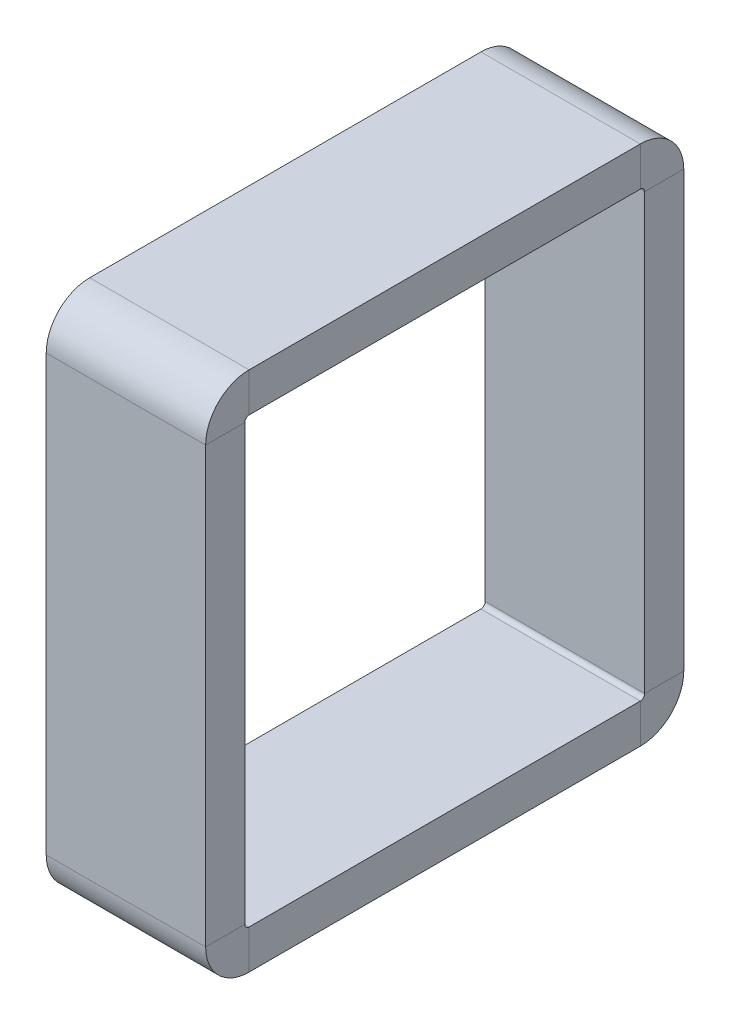
ISO-10303-21;
HEADER;
FILE_DESCRIPTION(('STEP AP214'),'2;1');
FILE_NAME('part.step','',(''),(''),'','','');
FILE_SCHEMA(('AUTOMOTIVE_DESIGN { 1 0 10303 214 1 1 1 1 }'));
ENDSEC;
DATA;
#1=APPLICATION_CONTEXT('core data for automotive mechanical design processes');
#2=APPLICATION_PROTOCOL_DEFINITION('international standard','automotive_design',2000,#1);
#3=PRODUCT_CONTEXT('',#1,'mechanical');
#4=PRODUCT('Part','Part','',(#3));
#5=PRODUCT_RELATED_PRODUCT_CATEGORY('part','',(#4));
#6=PRODUCT_DEFINITION_FORMATION('','',#4);
#7=PRODUCT_DEFINITION_CONTEXT('part definition',#1,'design');
#8=PRODUCT_DEFINITION('design','',#6,#7);
#9=PRODUCT_DEFINITION_SHAPE('','',#8);
#10=(LENGTH_UNIT() NAMED_UNIT(*) SI_UNIT(.MILLI.,.METRE.));
#11=(NAMED_UNIT(*) PLANE_ANGLE_UNIT() SI_UNIT($,.RADIAN.));
#12=(NAMED_UNIT(*) SI_UNIT($,.STERADIAN.) SOLID_ANGLE_UNIT());
#13=UNCERTAINTY_MEASURE_WITH_UNIT(LENGTH_MEASURE(1.E-05),#10,'distance_accuracy_value','');
#14=(GEOMETRIC_REPRESENTATION_CONTEXT(3) GLOBAL_UNCERTAINTY_ASSIGNED_CONTEXT((#13)) GLOBAL_UNIT_ASSIGNED_CONTEXT((#10,
#11,#12)) REPRESENTATION_CONTEXT('',''));
#15=CARTESIAN_POINT('',(0.,0.,0.));
#16=DIRECTION('',(0.,0.,1.));
#17=DIRECTION('',(1.,0.,0.));
#18=AXIS2_PLACEMENT_3D('',#15,#16,#17);
#19=CARTESIAN_POINT('',(-3.71677795736343,-0.754999569129981,-3.24612158699929));
#20=DIRECTION('',(1.,-1.74845553146952E-07,0.));
#21=DIRECTION('',(0.,8.74227765734758E-08,-1.));
#22=AXIS2_PLACEMENT_3D('',#19,#20,#21);
#23=PLANE('',#22);
#24=CARTESIAN_POINT('',(-3.7167779564892,-0.749999568692863,-3.25112158656218));
#25=DIRECTION('',(-0.999999999999985,1.74845553146949E-07,0.));
#26=DIRECTION('',(1.74845553146948E-07,0.999999999999981,8.74190497768619E-08));
#27=AXIS2_PLACEMENT_3D('',#24,#25,#26);
#28=CIRCLE('',#27,0.00999999999999571);
#29=CARTESIAN_POINT('',(-3.71677795474075,-0.739999568692867,-3.25112158568795));
#30=VERTEX_POINT('',#29);
#31=CARTESIAN_POINT('',(-3.7167779564892,-0.749999567819639,-3.26112158656218));
#32=VERTEX_POINT('',#31);
#33=EDGE_CURVE('E11',#30,#32,#28,.T.);
#34=ORIENTED_EDGE('',*,*,#33,.F.);
#35=DIRECTION('',(-1.74845555319994E-07,-0.999999999999981,-8.74227801271592E-08));
#36=VECTOR('',#35,1.);
#37=CARTESIAN_POINT('',(-3.71677793900465,-0.649999568693867,-3.2511215778209));
#38=LINE('',#37,#36);
#39=CARTESIAN_POINT('',(-3.71677793900465,-0.649999568693867,-3.2511215778199));
#40=VERTEX_POINT('',#39);
#41=EDGE_CURVE('E295',#40,#30,#38,.T.);
#42=ORIENTED_EDGE('',*,*,#41,.F.);
#43=CARTESIAN_POINT('',(-3.7167779564892,-0.749999568693535,-3.25112158656251));
#44=DIRECTION('',(0.999999999999985,-1.74845553146949E-07,0.));
#45=DIRECTION('',(0.,8.74290018163111E-08,-0.999999999999996));
#46=AXIS2_PLACEMENT_3D('',#43,#44,#45);
#47=CIRCLE('',#46,0.0999999999996649);
#48=CARTESIAN_POINT('',(-3.7167779564892,-0.749999559951589,-3.35112158656218));
#49=VERTEX_POINT('',#48);
#50=EDGE_CURVE('E292',#49,#40,#47,.T.);
#51=ORIENTED_EDGE('',*,*,#50,.F.);
#52=DIRECTION('',(0.,8.74227825933516E-08,-0.999999999999996));
#53=VECTOR('',#52,1.);
#54=CARTESIAN_POINT('',(-3.7167779564892,-0.749999567818639,-3.26112158656218));
#55=LINE('',#54,#53);
#56=EDGE_CURVE('E281',#32,#49,#55,.T.);
#57=ORIENTED_EDGE('',*,*,#56,.F.);
#58=EDGE_LOOP('',(#34,#42,#51,#57));
#59=FACE_BOUND('',#58,.T.);
#60=ADVANCED_FACE('F17',(#59),#23,.F.);
#61=CARTESIAN_POINT('',(-3.35000013200843,-0.754999633259452,-3.24612158699929));
#62=DIRECTION('',(1.,-1.74845553146952E-07,0.));
#63=DIRECTION('',(0.,8.74227765734758E-08,-1.));
#64=AXIS2_PLACEMENT_3D('',#61,#62,#63);
#65=PLANE('',#64);
#66=DIRECTION('',(0.,8.74227764254459E-08,-0.999999999999996));
#67=VECTOR('',#66,1.);
#68=CARTESIAN_POINT('',(-3.3500001311342,-0.749999631948111,-3.26112158656218));
#69=LINE('',#68,#67);
#70=CARTESIAN_POINT('',(-3.3500001311342,-0.749999631949111,-3.26112158656218));
#71=VERTEX_POINT('',#70);
#72=CARTESIAN_POINT('',(-3.3500001311342,-0.749999624081061,-3.35112158656218));
#73=VERTEX_POINT('',#72);
#74=EDGE_CURVE('E24',#71,#73,#69,.T.);
#75=ORIENTED_EDGE('',*,*,#74,.T.);
#76=CARTESIAN_POINT('',(-3.3500001311342,-0.749999632823002,-3.25112158656251));
#77=DIRECTION('',(0.999999999999985,-1.74845553146949E-07,0.));
#78=DIRECTION('',(0.,8.74294103783842E-08,-0.999999999999996));
#79=AXIS2_PLACEMENT_3D('',#76,#77,#78);
#80=CIRCLE('',#79,0.0999999999996649);
#81=CARTESIAN_POINT('',(-3.35000011364965,-0.649999632822338,-3.2511215778199));
#82=VERTEX_POINT('',#81);
#83=EDGE_CURVE('E290',#73,#82,#80,.T.);
#84=ORIENTED_EDGE('',*,*,#83,.T.);
#85=DIRECTION('',(1.74845555319994E-07,0.999999999999981,8.74227801271592E-08));
#86=VECTOR('',#85,1.);
#87=CARTESIAN_POINT('',(-3.35000012938575,-0.739999632822338,-3.25112158568895));
#88=LINE('',#87,#86);
#89=CARTESIAN_POINT('',(-3.35000012938575,-0.739999632822338,-3.25112158568795));
#90=VERTEX_POINT('',#89);
#91=EDGE_CURVE('E284',#90,#82,#88,.T.);
#92=ORIENTED_EDGE('',*,*,#91,.F.);
#93=CARTESIAN_POINT('',(-3.3500001311342,-0.749999632822289,-3.25112158656223));
#94=DIRECTION('',(-0.999999999999985,1.74845553146949E-07,0.));
#95=DIRECTION('',(1.74845553146948E-07,0.999999999999981,8.7427665107533E-08));
#96=AXIS2_PLACEMENT_3D('',#93,#94,#95);
#97=CIRCLE('',#96,0.00999999999999571);
#98=EDGE_CURVE('E274',#90,#71,#97,.T.);
#99=ORIENTED_EDGE('',*,*,#98,.T.);
#100=EDGE_LOOP('',(#75,#84,#92,#99));
#101=FACE_BOUND('',#100,.T.);
#102=ADVANCED_FACE('F409',(#101),#65,.T.);
#103=CARTESIAN_POINT('',(-3.7167779564892,-0.749999568693535,-3.25112158656251));
#104=DIRECTION('',(1.,-1.74845540855596E-07,0.));
#105=DIRECTION('',(-1.74845540855597E-07,-1.,-8.74227765734759E-08));
#106=AXIS2_PLACEMENT_3D('',#103,#104,#105);
#107=CYLINDRICAL_SURFACE('',#106,0.0999999999996679);
#108=ORIENTED_EDGE('',*,*,#50,.T.);
#109=DIRECTION('',(-0.999999999999985,1.74845553083486E-07,0.));
#110=VECTOR('',#109,1.);
#111=CARTESIAN_POINT('',(-3.35000011364965,-0.649999632823338,-3.2511215778209));
#112=LINE('',#111,#110);
#113=EDGE_CURVE('E287',#82,#40,#112,.T.);
#114=ORIENTED_EDGE('',*,*,#113,.F.);
#115=ORIENTED_EDGE('',*,*,#83,.F.);
#116=DIRECTION('',(0.999999999999985,-1.74845553083486E-07,0.));
#117=VECTOR('',#116,1.);
#118=CARTESIAN_POINT('',(-3.7167779564892,-0.749999559950589,-3.35112158656218));
#119=LINE('',#118,#117);
#120=EDGE_CURVE('E268',#49,#73,#119,.T.);
#121=ORIENTED_EDGE('',*,*,#120,.F.);
#122=EDGE_LOOP('',(#108,#114,#115,#121));
#123=FACE_BOUND('',#122,.T.);
#124=ADVANCED_FACE('F345',(#123),#107,.T.);
#125=CARTESIAN_POINT('',(-3.7167779564892,-0.749999568692863,-3.25112158656218));
#126=DIRECTION('',(-1.,1.74845430233397E-07,1.22913533173692E-13));
#127=DIRECTION('',(-1.74845430233408E-07,-1.,-8.74227765734759E-08));
#128=AXIS2_PLACEMENT_3D('',#125,#126,#127);
#129=CYLINDRICAL_SURFACE('',#128,0.00999999999999601);
#130=ORIENTED_EDGE('',*,*,#33,.T.);
#131=DIRECTION('',(0.999999999999985,-1.74844189739207E-07,0.));
#132=VECTOR('',#131,1.);
#133=CARTESIAN_POINT('',(-3.7167779564892,-0.749999567818889,-3.26112158656218));
#134=LINE('',#133,#132);
#135=EDGE_CURVE('E276',#32,#71,#134,.T.);
#136=ORIENTED_EDGE('',*,*,#135,.T.);
#137=ORIENTED_EDGE('',*,*,#98,.F.);
#138=DIRECTION('',(0.999999999999985,-1.74845553083486E-07,0.));
#139=VECTOR('',#138,1.);
#140=CARTESIAN_POINT('',(-3.71677795474075,-0.739999568692867,-3.25112158568895));
#141=LINE('',#140,#139);
#142=EDGE_CURVE('E262',#30,#90,#141,.T.);
#143=ORIENTED_EDGE('',*,*,#142,.F.);
#144=EDGE_LOOP('',(#130,#136,#137,#143));
#145=FACE_BOUND('',#144,.T.);
#146=ADVANCED_FACE('F304',(#145),#129,.F.);
#147=CARTESIAN_POINT('',(-3.71677793900466,-0.649999647374366,-2.3511215778209));
#148=DIRECTION('',(1.,-1.74845553146952E-07,0.));
#149=DIRECTION('',(-1.74845553146952E-07,-1.,-8.74227765734759E-08));
#150=AXIS2_PLACEMENT_3D('',#147,#148,#149);
#151=PLANE('',#150);
#152=DIRECTION('',(0.,8.7422776548804E-08,-0.999999999999996));
#153=VECTOR('',#152,1.);
#154=CARTESIAN_POINT('',(-3.71677793900466,-0.649999647374366,-2.3511215778209));
#155=LINE('',#154,#153);
#156=CARTESIAN_POINT('',(-3.71677793900366,-0.649999647377366,-2.3511215778179));
#157=VERTEX_POINT('',#156);
#158=EDGE_CURVE('E278',#157,#40,#155,.T.);
#159=ORIENTED_EDGE('',*,*,#158,.T.);
#160=ORIENTED_EDGE('',*,*,#41,.T.);
#161=DIRECTION('',(0.,8.74227765488039E-08,-0.999999999999996));
#162=VECTOR('',#161,1.);
#163=CARTESIAN_POINT('',(-3.71677795474076,-0.739999647373366,-2.35112158568895));
#164=LINE('',#163,#162);
#165=CARTESIAN_POINT('',(-3.71677795473976,-0.739999647376365,-2.35112158568595));
#166=VERTEX_POINT('',#165);
#167=EDGE_CURVE('E265',#166,#30,#164,.T.);
#168=ORIENTED_EDGE('',*,*,#167,.F.);
#169=DIRECTION('',(-1.74845550387524E-07,-0.999999999999981,-8.74121663959712E-08));
#170=VECTOR('',#169,1.);
#171=CARTESIAN_POINT('',(-3.71677793900366,-0.649999647375321,-2.35112157782185));
#172=LINE('',#171,#170);
#173=EDGE_CURVE('E147',#157,#166,#172,.T.);
#174=ORIENTED_EDGE('',*,*,#173,.F.);
#175=EDGE_LOOP('',(#159,#160,#168,#174));
#176=FACE_BOUND('',#175,.T.);
#177=ADVANCED_FACE('F297',(#176),#151,.F.);
#178=CARTESIAN_POINT('',(-3.35000011364966,-0.649999711503837,-2.3511215778209));
#179=DIRECTION('',(-1.74845553146952E-07,-1.,-8.74227765734759E-08));
#180=DIRECTION('',(-1.,1.74845553146952E-07,0.));
#181=AXIS2_PLACEMENT_3D('',#178,#179,#180);
#182=PLANE('',#181);
#183=DIRECTION('',(0.,8.7422776548804E-08,-0.999999999999996));
#184=VECTOR('',#183,1.);
#185=CARTESIAN_POINT('',(-3.35000011364966,-0.649999711503837,-2.3511215778209));
#186=LINE('',#185,#184);
#187=CARTESIAN_POINT('',(-3.35000011365066,-0.649999711506837,-2.3511215778179));
#188=VERTEX_POINT('',#187);
#189=EDGE_CURVE('E271',#188,#82,#186,.T.);
#190=ORIENTED_EDGE('',*,*,#189,.T.);
#191=ORIENTED_EDGE('',*,*,#113,.T.);
#192=ORIENTED_EDGE('',*,*,#158,.F.);
#193=DIRECTION('',(-0.999999999999985,1.74845553083486E-07,0.));
#194=VECTOR('',#193,1.);
#195=CARTESIAN_POINT('',(-3.35000011364966,-0.649999711503837,-2.3511215778209));
#196=LINE('',#195,#194);
#197=EDGE_CURVE('E255',#188,#157,#196,.T.);
#198=ORIENTED_EDGE('',*,*,#197,.F.);
#199=EDGE_LOOP('',(#190,#191,#192,#198));
#200=FACE_BOUND('',#199,.T.);
#201=ADVANCED_FACE('F342',(#200),#182,.F.);
#202=CARTESIAN_POINT('',(-3.71677795474076,-0.739999647373366,-2.35112158568895));
#203=DIRECTION('',(1.74845553146952E-07,1.,8.74227765734759E-08));
#204=DIRECTION('',(1.,-1.74845553146952E-07,0.));
#205=AXIS2_PLACEMENT_3D('',#202,#203,#204);
#206=PLANE('',#205);
#207=ORIENTED_EDGE('',*,*,#167,.T.);
#208=ORIENTED_EDGE('',*,*,#142,.T.);
#209=DIRECTION('',(0.,8.74227765488039E-08,-0.999999999999996));
#210=VECTOR('',#209,1.);
#211=CARTESIAN_POINT('',(-3.35000012938576,-0.739999711502837,-2.35112158568895));
#212=LINE('',#211,#210);
#213=CARTESIAN_POINT('',(-3.35000012938676,-0.739999711505837,-2.35112158568595));
#214=VERTEX_POINT('',#213);
#215=EDGE_CURVE('E259',#214,#90,#212,.T.);
#216=ORIENTED_EDGE('',*,*,#215,.F.);
#217=DIRECTION('',(0.999999999999985,-1.74845553083486E-07,0.));
#218=VECTOR('',#217,1.);
#219=CARTESIAN_POINT('',(-3.71677795474076,-0.739999647373366,-2.35112158568895));
#220=LINE('',#219,#218);
#221=EDGE_CURVE('E251',#166,#214,#220,.T.);
#222=ORIENTED_EDGE('',*,*,#221,.F.);
#223=EDGE_LOOP('',(#207,#208,#216,#222));
#224=FACE_BOUND('',#223,.T.);
#225=ADVANCED_FACE('F301',(#224),#206,.F.);
#226=CARTESIAN_POINT('',(-3.35000012938576,-0.739999711502837,-2.35112158568895));
#227=DIRECTION('',(-1.,1.74845553146952E-07,0.));
#228=DIRECTION('',(1.74845553146952E-07,1.,8.74227765734759E-08));
#229=AXIS2_PLACEMENT_3D('',#226,#227,#228);
#230=PLANE('',#229);
#231=ORIENTED_EDGE('',*,*,#215,.T.);
#232=ORIENTED_EDGE('',*,*,#91,.T.);
#233=ORIENTED_EDGE('',*,*,#189,.F.);
#234=DIRECTION('',(1.7484555038515E-07,0.999999999999981,8.74231995444866E-08));
#235=VECTOR('',#234,1.);
#236=CARTESIAN_POINT('',(-3.35000012938676,-0.739999711503105,-2.35112158568899));
#237=LINE('',#236,#235);
#238=EDGE_CURVE('E242',#214,#188,#237,.T.);
#239=ORIENTED_EDGE('',*,*,#238,.F.);
#240=EDGE_LOOP('',(#231,#232,#233,#239));
#241=FACE_BOUND('',#240,.T.);
#242=ADVANCED_FACE('F308',(#241),#230,.F.);
#243=CARTESIAN_POINT('',(-3.71677814007703,-1.79999955557945,-3.40112167835709));
#244=DIRECTION('',(-1.,1.74845553146952E-07,0.));
#245=DIRECTION('',(0.,-8.74227765734759E-08,1.));
#246=AXIS2_PLACEMENT_3D('',#243,#244,#245);
#247=PLANE('',#246);
#248=ORIENTED_EDGE('',*,*,#56,.T.);
#249=DIRECTION('',(-1.74845553146948E-07,-0.999999999999981,-8.74247767512754E-08));
#250=VECTOR('',#249,1.);
#251=CARTESIAN_POINT('',(-3.7167779564892,-0.749999559950589,-3.35112158656218));
#252=LINE('',#251,#250);
#253=CARTESIAN_POINT('',(-3.71677813133475,-1.74999955994959,-3.35112167398595));
#254=VERTEX_POINT('',#253);
#255=EDGE_CURVE('E253',#49,#254,#252,.T.);
#256=ORIENTED_EDGE('',*,*,#255,.T.);
#257=DIRECTION('',(0.,-8.74338872897881E-08,0.999999999999996));
#258=VECTOR('',#257,1.);
#259=CARTESIAN_POINT('',(-3.71677813133475,-1.74999955995059,-3.35112167398695));
#260=LINE('',#259,#258);
#261=CARTESIAN_POINT('',(-3.71677813133376,-1.74999956781864,-3.26112167398595));
#262=VERTEX_POINT('',#261);
#263=EDGE_CURVE('E245',#254,#262,#260,.T.);
#264=ORIENTED_EDGE('',*,*,#263,.T.);
#265=DIRECTION('',(1.74845553146774E-07,0.999999999999981,8.74237762181981E-08));
#266=VECTOR('',#265,1.);
#267=CARTESIAN_POINT('',(-3.71677813133476,-1.74999956781964,-3.26112167398595));
#268=LINE('',#267,#266);
#269=EDGE_CURVE('E233',#262,#32,#268,.T.);
#270=ORIENTED_EDGE('',*,*,#269,.T.);
#271=EDGE_LOOP('',(#248,#256,#264,#270));
#272=FACE_BOUND('',#271,.T.);
#273=ADVANCED_FACE('F350',(#272),#247,.T.);
#274=CARTESIAN_POINT('',(-3.7167779564892,-0.749999559950589,-3.35112158656218));
#275=DIRECTION('',(0.,-8.7424776751277E-08,1.));
#276=DIRECTION('',(-1.74845553146952E-07,-1.,-8.7424776751277E-08));
#277=AXIS2_PLACEMENT_3D('',#274,#275,#276);
#278=PLANE('',#277);
#279=ORIENTED_EDGE('',*,*,#120,.T.);
#280=DIRECTION('',(-1.74845553146948E-07,-0.999999999999981,-8.74247767512754E-08));
#281=VECTOR('',#280,1.);
#282=CARTESIAN_POINT('',(-3.3500001311342,-0.749999624080061,-3.35112158656218));
#283=LINE('',#282,#281);
#284=CARTESIAN_POINT('',(-3.35000030598076,-1.74999962407906,-3.35112167398595));
#285=VERTEX_POINT('',#284);
#286=EDGE_CURVE('E247',#73,#285,#283,.T.);
#287=ORIENTED_EDGE('',*,*,#286,.T.);
#288=DIRECTION('',(0.999999999999985,-1.74845553083486E-07,0.));
#289=VECTOR('',#288,1.);
#290=CARTESIAN_POINT('',(-3.71677813133476,-1.74999955995059,-3.35112167398695));
#291=LINE('',#290,#289);
#292=EDGE_CURVE('E236',#254,#285,#291,.T.);
#293=ORIENTED_EDGE('',*,*,#292,.F.);
#294=ORIENTED_EDGE('',*,*,#255,.F.);
#295=EDGE_LOOP('',(#279,#287,#293,#294));
#296=FACE_BOUND('',#295,.T.);
#297=ADVANCED_FACE('F364',(#296),#278,.F.);
#298=CARTESIAN_POINT('',(-3.71677813133476,-1.74999956781964,-3.26112167398595));
#299=DIRECTION('',(0.,8.74237762182872E-08,-1.));
#300=DIRECTION('',(1.74845553146952E-07,1.,8.74237762182872E-08));
#301=AXIS2_PLACEMENT_3D('',#298,#299,#300);
#302=PLANE('',#301);
#303=DIRECTION('',(0.999999999999985,-1.74844189739207E-07,0.));
#304=VECTOR('',#303,1.);
#305=CARTESIAN_POINT('',(-3.71677813133476,-1.74999956781939,-3.26112167398595));
#306=LINE('',#305,#304);
#307=CARTESIAN_POINT('',(-3.35000030598076,-1.74999963194711,-3.26112167398595));
#308=VERTEX_POINT('',#307);
#309=EDGE_CURVE('E249',#262,#308,#306,.T.);
#310=ORIENTED_EDGE('',*,*,#309,.T.);
#311=DIRECTION('',(1.74845553146861E-07,0.999999999999981,8.74237762182418E-08));
#312=VECTOR('',#311,1.);
#313=CARTESIAN_POINT('',(-3.35000030597976,-1.74999963194836,-3.26112167398595));
#314=LINE('',#313,#312);
#315=EDGE_CURVE('E239',#308,#71,#314,.T.);
#316=ORIENTED_EDGE('',*,*,#315,.T.);
#317=ORIENTED_EDGE('',*,*,#135,.F.);
#318=ORIENTED_EDGE('',*,*,#269,.F.);
#319=EDGE_LOOP('',(#310,#316,#317,#318));
#320=FACE_BOUND('',#319,.T.);
#321=ADVANCED_FACE('F355',(#320),#302,.F.);
#322=CARTESIAN_POINT('',(-3.35000031472203,-1.79999961970892,-3.40112167835709));
#323=DIRECTION('',(-1.,1.74845553146952E-07,0.));
#324=DIRECTION('',(0.,-8.74227765734759E-08,1.));
#325=AXIS2_PLACEMENT_3D('',#322,#323,#324);
#326=PLANE('',#325);
#327=ORIENTED_EDGE('',*,*,#315,.F.);
#328=DIRECTION('',(0.,-8.74333864567739E-08,0.999999999999996));
#329=VECTOR('',#328,1.);
#330=CARTESIAN_POINT('',(-3.35000030597975,-1.74999962407911,-3.351121673986));
#331=LINE('',#330,#329);
#332=EDGE_CURVE('E228',#285,#308,#331,.T.);
#333=ORIENTED_EDGE('',*,*,#332,.F.);
#334=ORIENTED_EDGE('',*,*,#286,.F.);
#335=ORIENTED_EDGE('',*,*,#74,.F.);
#336=EDGE_LOOP('',(#327,#333,#334,#335));
#337=FACE_BOUND('',#336,.T.);
#338=ADVANCED_FACE('F361',(#337),#326,.F.);
#339=CARTESIAN_POINT('',(-3.71677814969354,-1.85499956912898,-3.24612168316634));
#340=DIRECTION('',(1.,-1.74845553146952E-07,0.));
#341=DIRECTION('',(0.,8.74227765734759E-08,-1.));
#342=AXIS2_PLACEMENT_3D('',#339,#340,#341);
#343=PLANE('',#342);
#344=CARTESIAN_POINT('',(-3.71677813133476,-1.74999956869287,-3.25112167398596));
#345=DIRECTION('',(-0.999999999999985,1.74845553146949E-07,0.));
#346=DIRECTION('',(0.,8.74249561633322E-08,-0.999999999999996));
#347=AXIS2_PLACEMENT_3D('',#344,#345,#346);
#348=CIRCLE('',#347,0.0099999999999977);
#349=CARTESIAN_POINT('',(-3.71677813308221,-1.75999956869287,-3.25112167486018));
#350=VERTEX_POINT('',#349);
#351=EDGE_CURVE('E231',#262,#350,#348,.T.);
#352=ORIENTED_EDGE('',*,*,#351,.F.);
#353=ORIENTED_EDGE('',*,*,#263,.F.);
#354=CARTESIAN_POINT('',(-3.71677813133476,-1.74999956869307,-3.25112167398716));
#355=DIRECTION('',(0.999999999999985,-1.74845553146949E-07,0.));
#356=DIRECTION('',(-1.74845553146948E-07,-0.999999999999981,-8.74205197131637E-08));
#357=AXIS2_PLACEMENT_3D('',#354,#355,#356);
#358=CIRCLE('',#357,0.099999999998794);
#359=CARTESIAN_POINT('',(-3.71677814881831,-1.84999956869187,-3.25112168272823));
#360=VERTEX_POINT('',#359);
#361=EDGE_CURVE('E225',#360,#254,#358,.T.);
#362=ORIENTED_EDGE('',*,*,#361,.F.);
#363=DIRECTION('',(-1.74845555319994E-07,-0.999999999999981,-8.74338823574056E-08));
#364=VECTOR('',#363,1.);
#365=CARTESIAN_POINT('',(-3.71677813308321,-1.75999956869287,-3.25112167486018));
#366=LINE('',#365,#364);
#367=EDGE_CURVE('E215',#350,#360,#366,.T.);
#368=ORIENTED_EDGE('',*,*,#367,.F.);
#369=EDGE_LOOP('',(#352,#353,#362,#368));
#370=FACE_BOUND('',#369,.T.);
#371=ADVANCED_FACE('F372',(#370),#343,.F.);
#372=CARTESIAN_POINT('',(-3.71677813133475,-1.74999956869307,-3.25112167398716));
#373=DIRECTION('',(1.,-1.74845565438305E-07,0.));
#374=DIRECTION('',(-1.74845565438306E-07,-1.,-8.74227765734759E-08));
#375=AXIS2_PLACEMENT_3D('',#372,#373,#374);
#376=CYLINDRICAL_SURFACE('',#375,0.0999999999987971);
#377=ORIENTED_EDGE('',*,*,#361,.T.);
#378=ORIENTED_EDGE('',*,*,#292,.T.);
#379=CARTESIAN_POINT('',(-3.35000030597976,-1.74999963282255,-3.25112167398716));
#380=DIRECTION('',(0.999999999999985,-1.74845553146949E-07,0.));
#381=DIRECTION('',(-1.74845553146948E-07,-0.999999999999981,-8.74204753042427E-08));
#382=AXIS2_PLACEMENT_3D('',#379,#380,#381);
#383=CIRCLE('',#382,0.099999999998794);
#384=CARTESIAN_POINT('',(-3.35000032346531,-1.84999963282134,-3.25112168272823));
#385=VERTEX_POINT('',#384);
#386=EDGE_CURVE('E218',#385,#285,#383,.T.);
#387=ORIENTED_EDGE('',*,*,#386,.F.);
#388=DIRECTION('',(0.999999999999985,-1.74845553083487E-07,0.));
#389=VECTOR('',#388,1.);
#390=CARTESIAN_POINT('',(-3.71677814881931,-1.84999956869187,-3.25112168272923));
#391=LINE('',#390,#389);
#392=EDGE_CURVE('E209',#360,#385,#391,.T.);
#393=ORIENTED_EDGE('',*,*,#392,.F.);
#394=EDGE_LOOP('',(#377,#378,#387,#393));
#395=FACE_BOUND('',#394,.T.);
#396=ADVANCED_FACE('F368',(#395),#376,.T.);
#397=CARTESIAN_POINT('',(-3.71677813133475,-1.74999956869287,-3.25112167398596));
#398=DIRECTION('',(-1.,1.74845676060485E-07,1.22913554664589E-13));
#399=DIRECTION('',(-1.74845676060496E-07,-1.,-8.74227765734759E-08));
#400=AXIS2_PLACEMENT_3D('',#397,#398,#399);
#401=CYLINDRICAL_SURFACE('',#400,0.00999999999999801);
#402=ORIENTED_EDGE('',*,*,#351,.T.);
#403=DIRECTION('',(0.999999999999985,-1.74842826394926E-07,0.));
#404=VECTOR('',#403,1.);
#405=CARTESIAN_POINT('',(-3.71677813308321,-1.75999956869287,-3.25112167486018));
#406=LINE('',#405,#404);
#407=CARTESIAN_POINT('',(-3.35000030772921,-1.75999963282134,-3.25112167486018));
#408=VERTEX_POINT('',#407);
#409=EDGE_CURVE('E221',#350,#408,#406,.T.);
#410=ORIENTED_EDGE('',*,*,#409,.T.);
#411=CARTESIAN_POINT('',(-3.35000030597976,-1.74999963282239,-3.251121673986));
#412=DIRECTION('',(-0.999999999999985,1.74845553146949E-07,0.));
#413=DIRECTION('',(0.,8.75294725588704E-08,-0.999999999999996));
#414=AXIS2_PLACEMENT_3D('',#411,#412,#413);
#415=CIRCLE('',#414,0.0099999999999977);
#416=EDGE_CURVE('E212',#308,#408,#415,.T.);
#417=ORIENTED_EDGE('',*,*,#416,.F.);
#418=ORIENTED_EDGE('',*,*,#309,.F.);
#419=EDGE_LOOP('',(#402,#410,#417,#418));
#420=FACE_BOUND('',#419,.T.);
#421=ADVANCED_FACE('F374',(#420),#401,.F.);
#422=CARTESIAN_POINT('',(-3.35000032433854,-1.85499963325845,-3.24612168316634));
#423=DIRECTION('',(1.,-1.74845553146952E-07,0.));
#424=DIRECTION('',(0.,8.74227765734759E-08,-1.));
#425=AXIS2_PLACEMENT_3D('',#422,#423,#424);
#426=PLANE('',#425);
#427=DIRECTION('',(-1.74845550383717E-07,-0.999999999999981,-8.74348938929626E-08));
#428=VECTOR('',#427,1.);
#429=CARTESIAN_POINT('',(-3.35000030772821,-1.75999963282133,-3.25112167486009));
#430=LINE('',#429,#428);
#431=EDGE_CURVE('E223',#408,#385,#430,.T.);
#432=ORIENTED_EDGE('',*,*,#431,.T.);
#433=ORIENTED_EDGE('',*,*,#386,.T.);
#434=ORIENTED_EDGE('',*,*,#332,.T.);
#435=ORIENTED_EDGE('',*,*,#416,.T.);
#436=EDGE_LOOP('',(#432,#433,#434,#435));
#437=FACE_BOUND('',#436,.T.);
#438=ADVANCED_FACE('F377',(#437),#426,.T.);
#439=CARTESIAN_POINT('',(-3.71677815668736,-1.89499956476084,-3.29612168666326));
#440=DIRECTION('',(-1.,1.74845553146952E-07,0.));
#441=DIRECTION('',(0.,-8.74227765734759E-08,1.));
#442=AXIS2_PLACEMENT_3D('',#439,#440,#441);
#443=PLANE('',#442);
#444=ORIENTED_EDGE('',*,*,#367,.T.);
#445=DIRECTION('',(0.,-8.74261100551144E-08,0.999999999999996));
#446=VECTOR('',#445,1.);
#447=CARTESIAN_POINT('',(-3.71677814881931,-1.84999956869187,-3.25112168272923));
#448=LINE('',#447,#446);
#449=CARTESIAN_POINT('',(-3.71677814881832,-1.84999964737537,-2.35112168273023));
#450=VERTEX_POINT('',#449);
#451=EDGE_CURVE('E207',#360,#450,#448,.T.);
#452=ORIENTED_EDGE('',*,*,#451,.T.);
#453=DIRECTION('',(1.74845555318051E-07,0.999999999999981,8.74227653232141E-08));
#454=VECTOR('',#453,1.);
#455=CARTESIAN_POINT('',(-3.71677814881933,-1.84999964737537,-2.35112168272923));
#456=LINE('',#455,#454);
#457=CARTESIAN_POINT('',(-3.71677813308223,-1.75999964737537,-2.35112167486118));
#458=VERTEX_POINT('',#457);
#459=EDGE_CURVE('E201',#450,#458,#456,.T.);
#460=ORIENTED_EDGE('',*,*,#459,.T.);
#461=DIRECTION('',(0.,8.74249985986058E-08,-0.999999999999996));
#462=VECTOR('',#461,1.);
#463=CARTESIAN_POINT('',(-3.71677813308323,-1.75999964737537,-2.35112167486118));
#464=LINE('',#463,#462);
#465=EDGE_CURVE('E192',#458,#350,#464,.T.);
#466=ORIENTED_EDGE('',*,*,#465,.T.);
#467=EDGE_LOOP('',(#444,#452,#460,#466));
#468=FACE_BOUND('',#467,.T.);
#469=ADVANCED_FACE('F397',(#468),#443,.T.);
#470=CARTESIAN_POINT('',(-3.71677814881931,-1.84999956869187,-3.25112168272923));
#471=DIRECTION('',(1.74845553146952E-07,1.,8.74261099564282E-08));
#472=DIRECTION('',(0.,-8.74261099564282E-08,1.));
#473=AXIS2_PLACEMENT_3D('',#470,#471,#472);
#474=PLANE('',#473);
#475=ORIENTED_EDGE('',*,*,#392,.T.);
#476=DIRECTION('',(0.,-8.74261100551145E-08,0.999999999999996));
#477=VECTOR('',#476,1.);
#478=CARTESIAN_POINT('',(-3.35000032346431,-1.84999963282134,-3.25112168272923));
#479=LINE('',#478,#477);
#480=CARTESIAN_POINT('',(-3.35000032346533,-1.84999971150484,-2.35112168273023));
#481=VERTEX_POINT('',#480);
#482=EDGE_CURVE('E203',#385,#481,#479,.T.);
#483=ORIENTED_EDGE('',*,*,#482,.T.);
#484=DIRECTION('',(0.999999999999985,-1.74845553083486E-07,0.));
#485=VECTOR('',#484,1.);
#486=CARTESIAN_POINT('',(-3.71677814881933,-1.84999964737537,-2.35112168272923));
#487=LINE('',#486,#485);
#488=EDGE_CURVE('E195',#450,#481,#487,.T.);
#489=ORIENTED_EDGE('',*,*,#488,.F.);
#490=ORIENTED_EDGE('',*,*,#451,.F.);
#491=EDGE_LOOP('',(#475,#483,#489,#490));
#492=FACE_BOUND('',#491,.T.);
#493=ADVANCED_FACE('F381',(#492),#474,.F.);
#494=CARTESIAN_POINT('',(-3.71677813308323,-1.75999964737537,-2.35112167486118));
#495=DIRECTION('',(-1.74842826458391E-07,-1.,-8.74249987465387E-08));
#496=DIRECTION('',(0.,8.74249987465387E-08,-1.));
#497=AXIS2_PLACEMENT_3D('',#494,#495,#496);
#498=PLANE('',#497);
#499=DIRECTION('',(0.999999999999985,-1.74842826394926E-07,0.));
#500=VECTOR('',#499,1.);
#501=CARTESIAN_POINT('',(-3.71677813308323,-1.75999964737537,-2.35112167486118));
#502=LINE('',#501,#500);
#503=CARTESIAN_POINT('',(-3.35000030772923,-1.75999971150484,-2.35112167486118));
#504=VERTEX_POINT('',#503);
#505=EDGE_CURVE('E205',#458,#504,#502,.T.);
#506=ORIENTED_EDGE('',*,*,#505,.T.);
#507=DIRECTION('',(0.,8.7424998845322E-08,-0.999999999999996));
#508=VECTOR('',#507,1.);
#509=CARTESIAN_POINT('',(-3.35000030772823,-1.75999971150384,-2.35112167486118));
#510=LINE('',#509,#508);
#511=EDGE_CURVE('E198',#504,#408,#510,.T.);
#512=ORIENTED_EDGE('',*,*,#511,.T.);
#513=ORIENTED_EDGE('',*,*,#409,.F.);
#514=ORIENTED_EDGE('',*,*,#465,.F.);
#515=EDGE_LOOP('',(#506,#512,#513,#514));
#516=FACE_BOUND('',#515,.T.);
#517=ADVANCED_FACE('F398',(#516),#498,.F.);
#518=CARTESIAN_POINT('',(-3.35000033133236,-1.89499962889031,-3.29612168666326));
#519=DIRECTION('',(-1.,1.74845553146952E-07,0.));
#520=DIRECTION('',(0.,-8.74227765734759E-08,1.));
#521=AXIS2_PLACEMENT_3D('',#518,#519,#520);
#522=PLANE('',#521);
#523=ORIENTED_EDGE('',*,*,#511,.F.);
#524=DIRECTION('',(1.74845550383726E-07,0.999999999999981,8.74227751918632E-08));
#525=VECTOR('',#524,1.);
#526=CARTESIAN_POINT('',(-3.35000032346533,-1.84999971150484,-2.35112168272923));
#527=LINE('',#526,#525);
#528=EDGE_CURVE('E187',#481,#504,#527,.T.);
#529=ORIENTED_EDGE('',*,*,#528,.F.);
#530=ORIENTED_EDGE('',*,*,#482,.F.);
#531=ORIENTED_EDGE('',*,*,#431,.F.);
#532=EDGE_LOOP('',(#523,#529,#530,#531));
#533=FACE_BOUND('',#532,.T.);
#534=ADVANCED_FACE('F385',(#533),#522,.F.);
#535=CARTESIAN_POINT('',(-3.71677814969255,-1.85499965655476,-2.24612168316734));
#536=DIRECTION('',(1.,-1.74845553146952E-07,0.));
#537=DIRECTION('',(0.,8.74227765734759E-08,-1.));
#538=AXIS2_PLACEMENT_3D('',#535,#536,#537);
#539=PLANE('',#538);
#540=CARTESIAN_POINT('',(-3.71677813133377,-1.74999964737537,-2.35112167398695));
#541=DIRECTION('',(-0.999999999999985,1.74845553146949E-07,0.));
#542=DIRECTION('',(-1.74845553146948E-07,-0.999999999999981,-8.74229577618776E-08));
#543=AXIS2_PLACEMENT_3D('',#540,#541,#542);
#544=CIRCLE('',#543,0.00999999999999926);
#545=CARTESIAN_POINT('',(-3.71677813133377,-1.74999964824859,-2.34112167398695));
#546=VERTEX_POINT('',#545);
#547=EDGE_CURVE('E190',#458,#546,#544,.T.);
#548=ORIENTED_EDGE('',*,*,#547,.F.);
#549=ORIENTED_EDGE('',*,*,#459,.F.);
#550=CARTESIAN_POINT('',(-3.71677813133377,-1.74999964737539,-2.35112167398793));
#551=DIRECTION('',(0.999999999999985,-1.74845553146949E-07,0.));
#552=DIRECTION('',(0.,-8.74225314362545E-08,0.999999999999996));
#553=AXIS2_PLACEMENT_3D('',#550,#551,#552);
#554=CIRCLE('',#553,0.0999999999999726);
#555=CARTESIAN_POINT('',(-3.71677813133377,-1.74999965611764,-2.25112167398795));
#556=VERTEX_POINT('',#555);
#557=EDGE_CURVE('E184',#556,#450,#554,.T.);
#558=ORIENTED_EDGE('',*,*,#557,.F.);
#559=DIRECTION('',(0.,-8.74343930599545E-08,0.999999999999996));
#560=VECTOR('',#559,1.);
#561=CARTESIAN_POINT('',(-3.71677813133377,-1.74999964824955,-2.341121673987));
#562=LINE('',#561,#560);
#563=EDGE_CURVE('E176',#546,#556,#562,.T.);
#564=ORIENTED_EDGE('',*,*,#563,.F.);
#565=EDGE_LOOP('',(#548,#549,#558,#564));
#566=FACE_BOUND('',#565,.T.);
#567=ADVANCED_FACE('F395',(#566),#539,.F.);
#568=CARTESIAN_POINT('',(-3.71677813133377,-1.74999964737539,-2.35112167398793));
#569=DIRECTION('',(1.,-1.74845565438307E-07,0.));
#570=DIRECTION('',(-1.74845565438306E-07,-1.,-8.74227765734759E-08));
#571=AXIS2_PLACEMENT_3D('',#568,#569,#570);
#572=CYLINDRICAL_SURFACE('',#571,0.0999999999999757);
#573=ORIENTED_EDGE('',*,*,#557,.T.);
#574=ORIENTED_EDGE('',*,*,#488,.T.);
#575=CARTESIAN_POINT('',(-3.35000030598077,-1.74999971150487,-2.35112167398792));
#576=DIRECTION('',(0.999999999999985,-1.74845553146949E-07,0.));
#577=DIRECTION('',(0.,-8.74224914682257E-08,0.999999999999996));
#578=AXIS2_PLACEMENT_3D('',#575,#576,#577);
#579=CIRCLE('',#578,0.0999999999999726);
#580=CARTESIAN_POINT('',(-3.35000030598077,-1.74999972024711,-2.25112167398795));
#581=VERTEX_POINT('',#580);
#582=EDGE_CURVE('E178',#581,#481,#579,.T.);
#583=ORIENTED_EDGE('',*,*,#582,.F.);
#584=DIRECTION('',(0.999999999999985,-1.7484418974016E-07,0.));
#585=VECTOR('',#584,1.);
#586=CARTESIAN_POINT('',(-3.71677813133377,-1.74999965611839,-2.25112167398795));
#587=LINE('',#586,#585);
#588=EDGE_CURVE('E167',#556,#581,#587,.T.);
#589=ORIENTED_EDGE('',*,*,#588,.F.);
#590=EDGE_LOOP('',(#573,#574,#583,#589));
#591=FACE_BOUND('',#590,.T.);
#592=ADVANCED_FACE('F335',(#591),#572,.T.);
#593=CARTESIAN_POINT('',(-3.71677813133377,-1.74999964737537,-2.35112167398695));
#594=DIRECTION('',(-1.,1.74845676060506E-07,-1.229135331737E-13));
#595=DIRECTION('',(-1.74845676060496E-07,-1.,-8.74227765734759E-08));
#596=AXIS2_PLACEMENT_3D('',#593,#594,#595);
#597=CYLINDRICAL_SURFACE('',#596,0.00999999999999957);
#598=ORIENTED_EDGE('',*,*,#547,.T.);
#599=DIRECTION('',(0.999999999999985,-1.7484555308444E-07,0.));
#600=VECTOR('',#599,1.);
#601=CARTESIAN_POINT('',(-3.71677813133377,-1.74999964824959,-2.34112167398695));
#602=LINE('',#601,#600);
#603=CARTESIAN_POINT('',(-3.35000030598077,-1.74999971237806,-2.34112167398695));
#604=VERTEX_POINT('',#603);
#605=EDGE_CURVE('E158',#546,#604,#602,.T.);
#606=ORIENTED_EDGE('',*,*,#605,.T.);
#607=CARTESIAN_POINT('',(-3.35000030598077,-1.74999971150488,-2.35112167398691));
#608=DIRECTION('',(-0.999999999999985,1.74845553146949E-07,0.));
#609=DIRECTION('',(-1.74845553146948E-07,-0.999999999999981,-8.7427487471818E-08));
#610=AXIS2_PLACEMENT_3D('',#607,#608,#609);
#611=CIRCLE('',#610,0.00999999999999926);
#612=EDGE_CURVE('E173',#504,#604,#611,.T.);
#613=ORIENTED_EDGE('',*,*,#612,.F.);
#614=ORIENTED_EDGE('',*,*,#505,.F.);
#615=EDGE_LOOP('',(#598,#606,#613,#614));
#616=FACE_BOUND('',#615,.T.);
#617=ADVANCED_FACE('F389',(#616),#597,.F.);
#618=CARTESIAN_POINT('',(-3.35000032433955,-1.85499972068423,-2.24612168316734));
#619=DIRECTION('',(1.,-1.74845553146952E-07,0.));
#620=DIRECTION('',(0.,8.74227765734759E-08,-1.));
#621=AXIS2_PLACEMENT_3D('',#618,#619,#620);
#622=PLANE('',#621);
#623=DIRECTION('',(0.,-8.74227727256735E-08,0.999999999999996));
#624=VECTOR('',#623,1.);
#625=CARTESIAN_POINT('',(-3.35000030598077,-1.74999971237907,-2.34112167398695));
#626=LINE('',#625,#624);
#627=EDGE_CURVE('E182',#604,#581,#626,.T.);
#628=ORIENTED_EDGE('',*,*,#627,.T.);
#629=ORIENTED_EDGE('',*,*,#582,.T.);
#630=ORIENTED_EDGE('',*,*,#528,.T.);
#631=ORIENTED_EDGE('',*,*,#612,.T.);
#632=EDGE_LOOP('',(#628,#629,#630,#631));
#633=FACE_BOUND('',#632,.T.);
#634=ADVANCED_FACE('F331',(#633),#622,.T.);
#635=CARTESIAN_POINT('',(-3.71677814007605,-1.79999964387945,-2.39112167835809));
#636=DIRECTION('',(-1.,1.74845553146952E-07,0.));
#637=DIRECTION('',(0.,-8.74227765734759E-08,1.));
#638=AXIS2_PLACEMENT_3D('',#635,#636,#637);
#639=PLANE('',#638);
#640=ORIENTED_EDGE('',*,*,#563,.T.);
#641=DIRECTION('',(1.74845553146788E-07,0.999999999999981,8.74268057947948E-08));
#642=VECTOR('',#641,1.);
#643=CARTESIAN_POINT('',(-3.71677813133377,-1.74999965611856,-2.25112167398798));
#644=LINE('',#643,#642);
#645=CARTESIAN_POINT('',(-3.71677795648822,-0.749999656118643,-2.25112158656118));
#646=VERTEX_POINT('',#645);
#647=EDGE_CURVE('E135',#556,#646,#644,.T.);
#648=ORIENTED_EDGE('',*,*,#647,.T.);
#649=DIRECTION('',(0.,8.74224125202244E-08,-0.999999999999996));
#650=VECTOR('',#649,1.);
#651=CARTESIAN_POINT('',(-3.71677795648822,-0.74999965611761,-2.25112158656143));
#652=LINE('',#651,#650);
#653=CARTESIAN_POINT('',(-3.71677795648822,-0.749999648250593,-2.34112158656018));
#654=VERTEX_POINT('',#653);
#655=EDGE_CURVE('E127',#646,#654,#652,.T.);
#656=ORIENTED_EDGE('',*,*,#655,.T.);
#657=DIRECTION('',(-1.74845553146948E-07,-0.999999999999981,-8.74266858907881E-08));
#658=VECTOR('',#657,1.);
#659=CARTESIAN_POINT('',(-3.71677795648822,-0.749999648249589,-2.34112158656027));
#660=LINE('',#659,#658);
#661=EDGE_CURVE('E132',#654,#546,#660,.T.);
#662=ORIENTED_EDGE('',*,*,#661,.T.);
#663=EDGE_LOOP('',(#640,#648,#656,#662));
#664=FACE_BOUND('',#663,.T.);
#665=ADVANCED_FACE('F130',(#664),#639,.T.);
#666=CARTESIAN_POINT('',(-3.71677813133377,-1.74999965611864,-2.25112167398795));
#667=DIRECTION('',(0.,8.74267769290782E-08,-1.));
#668=DIRECTION('',(1.74845553146952E-07,1.,8.74267769290782E-08));
#669=AXIS2_PLACEMENT_3D('',#666,#667,#668);
#670=PLANE('',#669);
#671=ORIENTED_EDGE('',*,*,#588,.T.);
#672=DIRECTION('',(1.74845553146861E-07,0.999999999999981,8.74267769290328E-08));
#673=VECTOR('',#672,1.);
#674=CARTESIAN_POINT('',(-3.35000030598077,-1.74999972024736,-2.25112167398795));
#675=LINE('',#674,#673);
#676=CARTESIAN_POINT('',(-3.35000013113522,-0.749999720248115,-2.25112158656118));
#677=VERTEX_POINT('',#676);
#678=EDGE_CURVE('E139',#581,#677,#675,.T.);
#679=ORIENTED_EDGE('',*,*,#678,.T.);
#680=DIRECTION('',(0.999999999999985,-1.7484418974016E-07,0.));
#681=VECTOR('',#680,1.);
#682=CARTESIAN_POINT('',(-3.71677795648822,-0.749999656117893,-2.25112158656118));
#683=LINE('',#682,#681);
#684=EDGE_CURVE('E159',#646,#677,#683,.T.);
#685=ORIENTED_EDGE('',*,*,#684,.F.);
#686=ORIENTED_EDGE('',*,*,#647,.F.);
#687=EDGE_LOOP('',(#671,#679,#685,#686));
#688=FACE_BOUND('',#687,.T.);
#689=ADVANCED_FACE('F338',(#688),#670,.F.);
#690=CARTESIAN_POINT('',(-3.71677795648822,-0.749999648249593,-2.34112158656018));
#691=DIRECTION('',(0.,-8.7426776484989E-08,1.));
#692=DIRECTION('',(-1.74845553146952E-07,-1.,-8.7426776484989E-08));
#693=AXIS2_PLACEMENT_3D('',#690,#691,#692);
#694=PLANE('',#693);
#695=DIRECTION('',(0.999999999999985,-1.7484555308444E-07,0.));
#696=VECTOR('',#695,1.);
#697=CARTESIAN_POINT('',(-3.71677795648822,-0.749999648249593,-2.34112158656018));
#698=LINE('',#697,#696);
#699=CARTESIAN_POINT('',(-3.35000013113522,-0.749999712380065,-2.34112158656018));
#700=VERTEX_POINT('',#699);
#701=EDGE_CURVE('E156',#654,#700,#698,.T.);
#702=ORIENTED_EDGE('',*,*,#701,.T.);
#703=DIRECTION('',(-1.74845553146948E-07,-0.999999999999981,-8.74267764849873E-08));
#704=VECTOR('',#703,1.);
#705=CARTESIAN_POINT('',(-3.35000013113522,-0.749999712379065,-2.34112158656018));
#706=LINE('',#705,#704);
#707=EDGE_CURVE('E140',#700,#604,#706,.T.);
#708=ORIENTED_EDGE('',*,*,#707,.T.);
#709=ORIENTED_EDGE('',*,*,#605,.F.);
#710=ORIENTED_EDGE('',*,*,#661,.F.);
#711=EDGE_LOOP('',(#702,#708,#709,#710));
#712=FACE_BOUND('',#711,.T.);
#713=ADVANCED_FACE('F154',(#712),#694,.F.);
#714=CARTESIAN_POINT('',(-3.35000031472305,-1.79999970800793,-2.39112167835809));
#715=DIRECTION('',(-1.,1.74845553146952E-07,0.));
#716=DIRECTION('',(0.,-8.74227765734759E-08,1.));
#717=AXIS2_PLACEMENT_3D('',#714,#715,#716);
#718=PLANE('',#717);
#719=ORIENTED_EDGE('',*,*,#707,.F.);
#720=DIRECTION('',(0.,8.7423280961147E-08,-0.999999999999996));
#721=VECTOR('',#720,1.);
#722=CARTESIAN_POINT('',(-3.35000013113522,-0.74999972024716,-2.25112158656122));
#723=LINE('',#722,#721);
#724=EDGE_CURVE('E151',#677,#700,#723,.T.);
#725=ORIENTED_EDGE('',*,*,#724,.F.);
#726=ORIENTED_EDGE('',*,*,#678,.F.);
#727=ORIENTED_EDGE('',*,*,#627,.F.);
#728=EDGE_LOOP('',(#719,#725,#726,#727));
#729=FACE_BOUND('',#728,.T.);
#730=ADVANCED_FACE('F328',(#729),#718,.F.);
#731=CARTESIAN_POINT('',(-3.71677795736245,-0.754999656555757,-2.24612158699729));
#732=DIRECTION('',(1.,-1.74845553146952E-07,0.));
#733=DIRECTION('',(0.,8.74227765734759E-08,-1.));
#734=AXIS2_PLACEMENT_3D('',#731,#732,#733);
#735=PLANE('',#734);
#736=CARTESIAN_POINT('',(-3.71677795648822,-0.749999647376364,-2.35112158656017));
#737=DIRECTION('',(-0.999999999999985,1.74845553146949E-07,0.));
#738=DIRECTION('',(0.,-8.74274874718245E-08,0.999999999999996));
#739=AXIS2_PLACEMENT_3D('',#736,#737,#738);
#740=CIRCLE('',#739,0.00999999999999815);
#741=EDGE_CURVE('E144',#654,#166,#740,.T.);
#742=ORIENTED_EDGE('',*,*,#741,.F.);
#743=ORIENTED_EDGE('',*,*,#655,.F.);
#744=CARTESIAN_POINT('',(-3.71677795648822,-0.749999647375469,-2.35112158655928));
#745=DIRECTION('',(0.999999999999985,-1.74845553146949E-07,0.));
#746=DIRECTION('',(1.74845553146948E-07,0.999999999999981,8.74090355668027E-08));
#747=AXIS2_PLACEMENT_3D('',#744,#745,#746);
#748=CIRCLE('',#747,0.0999999999981009);
#749=EDGE_CURVE('E317',#157,#646,#748,.T.);
#750=ORIENTED_EDGE('',*,*,#749,.F.);
#751=ORIENTED_EDGE('',*,*,#173,.T.);
#752=EDGE_LOOP('',(#742,#743,#750,#751));
#753=FACE_BOUND('',#752,.T.);
#754=ADVANCED_FACE('F145',(#753),#735,.F.);
#755=CARTESIAN_POINT('',(-3.71677795648822,-0.749999647375469,-2.35112158655928));
#756=DIRECTION('',(1.,-1.74845540855598E-07,0.));
#757=DIRECTION('',(-1.74845540855597E-07,-1.,-8.74227765734759E-08));
#758=AXIS2_PLACEMENT_3D('',#755,#756,#757);
#759=CYLINDRICAL_SURFACE('',#758,0.0999999999981039);
#760=ORIENTED_EDGE('',*,*,#749,.T.);
#761=ORIENTED_EDGE('',*,*,#684,.T.);
#762=CARTESIAN_POINT('',(-3.35000013113522,-0.749999711504937,-2.35112158655927));
#763=DIRECTION('',(0.999999999999985,-1.74845553146949E-07,0.));
#764=DIRECTION('',(1.74845553146948E-07,0.999999999999981,8.74089911578817E-08));
#765=AXIS2_PLACEMENT_3D('',#762,#763,#764);
#766=CIRCLE('',#765,0.0999999999981009);
#767=EDGE_CURVE('E315',#188,#677,#766,.T.);
#768=ORIENTED_EDGE('',*,*,#767,.F.);
#769=ORIENTED_EDGE('',*,*,#197,.T.);
#770=EDGE_LOOP('',(#760,#761,#768,#769));
#771=FACE_BOUND('',#770,.T.);
#772=ADVANCED_FACE('F340',(#771),#759,.T.);
#773=CARTESIAN_POINT('',(-3.71677795648822,-0.749999647376364,-2.35112158656017));
#774=DIRECTION('',(-1.,1.74845430233419E-07,-1.22913554664604E-13));
#775=DIRECTION('',(-1.74845430233408E-07,-1.,-8.74227765734759E-08));
#776=AXIS2_PLACEMENT_3D('',#773,#774,#775);
#777=CYLINDRICAL_SURFACE('',#776,0.00999999999999845);
#778=ORIENTED_EDGE('',*,*,#741,.T.);
#779=ORIENTED_EDGE('',*,*,#221,.T.);
#780=CARTESIAN_POINT('',(-3.35000013113522,-0.74999971150579,-2.35112158656013));
#781=DIRECTION('',(-0.999999999999985,1.74845553146949E-07,0.));
#782=DIRECTION('',(0.,-8.74319949773083E-08,0.999999999999996));
#783=AXIS2_PLACEMENT_3D('',#780,#781,#782);
#784=CIRCLE('',#783,0.00999999999999815);
#785=EDGE_CURVE('E164',#700,#214,#784,.T.);
#786=ORIENTED_EDGE('',*,*,#785,.F.);
#787=ORIENTED_EDGE('',*,*,#701,.F.);
#788=EDGE_LOOP('',(#778,#779,#786,#787));
#789=FACE_BOUND('',#788,.T.);
#790=ADVANCED_FACE('F162',(#789),#777,.F.);
#791=CARTESIAN_POINT('',(-3.35000013200945,-0.754999720685229,-2.24612158699729));
#792=DIRECTION('',(1.,-1.74845553146952E-07,0.));
#793=DIRECTION('',(0.,8.74227765734759E-08,-1.));
#794=AXIS2_PLACEMENT_3D('',#791,#792,#793);
#795=PLANE('',#794);
#796=ORIENTED_EDGE('',*,*,#238,.T.);
#797=ORIENTED_EDGE('',*,*,#767,.T.);
#798=ORIENTED_EDGE('',*,*,#724,.T.);
#799=ORIENTED_EDGE('',*,*,#785,.T.);
#800=EDGE_LOOP('',(#796,#797,#798,#799));
#801=FACE_BOUND('',#800,.T.);
#802=ADVANCED_FACE('F313',(#801),#795,.T.);
#803=CLOSED_SHELL('',(#60,#102,#124,#146,#177,#201,#225,#242,#273,#297,#321,#338,#371,#396,#421,
#438,#469,#493,#517,#534,#567,#592,#617,#634,#665,#689,#713,#730,#754,#772,#790,#802));
#804=MANIFOLD_SOLID_BREP('B1',#803);
#805=ADVANCED_BREP_SHAPE_REPRESENTATION('',(#18,#804),#14);
#806=SHAPE_DEFINITION_REPRESENTATION(#9,#805);
ENDSEC;
END-ISO-10303-21;
